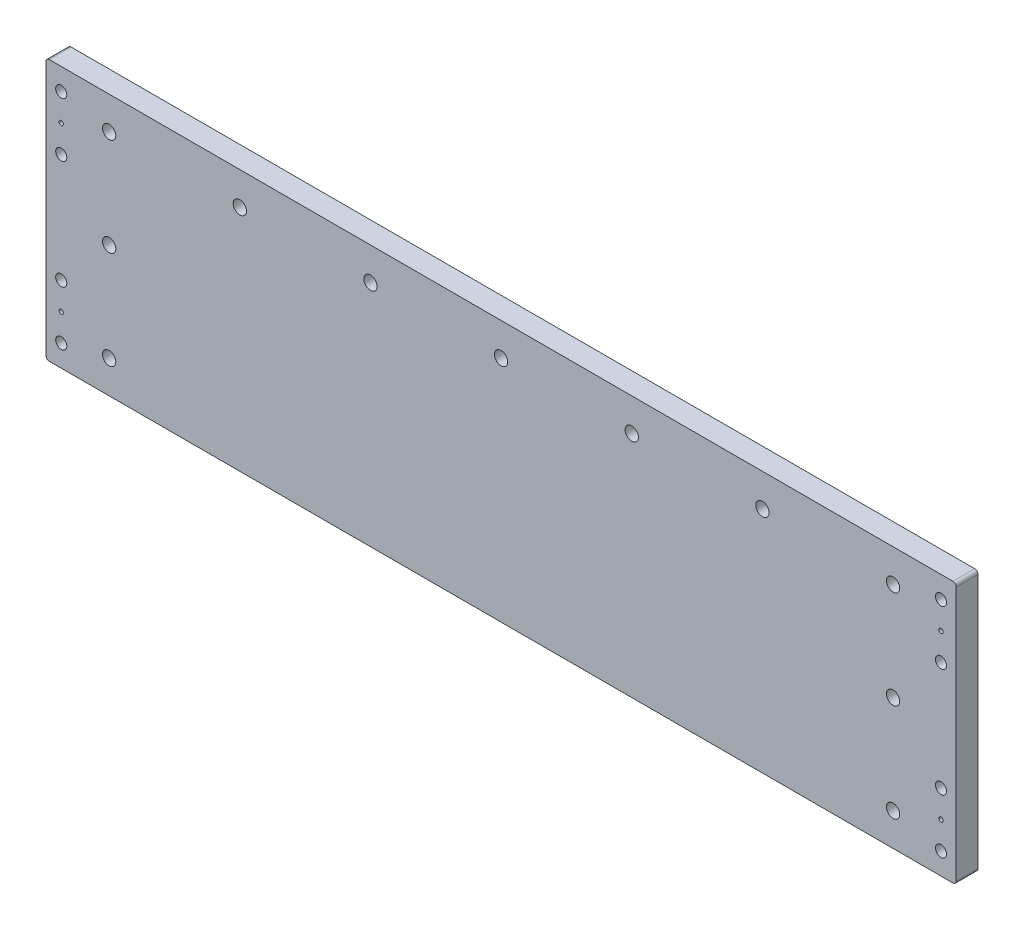
ISO-10303-21;
HEADER;
FILE_DESCRIPTION(('STEP AP214'),'2;1');
FILE_NAME('part.step','',(''),(''),'','','');
FILE_SCHEMA(('AUTOMOTIVE_DESIGN { 1 0 10303 214 1 1 1 1 }'));
ENDSEC;
DATA;
#1=APPLICATION_CONTEXT('core data for automotive mechanical design processes');
#2=APPLICATION_PROTOCOL_DEFINITION('international standard','automotive_design',2000,#1);
#3=PRODUCT_CONTEXT('',#1,'mechanical');
#4=PRODUCT('Part','Part','',(#3));
#5=PRODUCT_RELATED_PRODUCT_CATEGORY('part','',(#4));
#6=PRODUCT_DEFINITION_FORMATION('','',#4);
#7=PRODUCT_DEFINITION_CONTEXT('part definition',#1,'design');
#8=PRODUCT_DEFINITION('design','',#6,#7);
#9=PRODUCT_DEFINITION_SHAPE('','',#8);
#10=(LENGTH_UNIT() NAMED_UNIT(*) SI_UNIT(.MILLI.,.METRE.));
#11=(NAMED_UNIT(*) PLANE_ANGLE_UNIT() SI_UNIT($,.RADIAN.));
#12=(NAMED_UNIT(*) SI_UNIT($,.STERADIAN.) SOLID_ANGLE_UNIT());
#13=UNCERTAINTY_MEASURE_WITH_UNIT(LENGTH_MEASURE(1.E-05),#10,'distance_accuracy_value','');
#14=(GEOMETRIC_REPRESENTATION_CONTEXT(3) GLOBAL_UNCERTAINTY_ASSIGNED_CONTEXT((#13)) GLOBAL_UNIT_ASSIGNED_CONTEXT((#10,
#11,#12)) REPRESENTATION_CONTEXT('',''));
#15=CARTESIAN_POINT('',(0.,0.,0.));
#16=DIRECTION('',(0.,0.,1.));
#17=DIRECTION('',(1.,0.,0.));
#18=AXIS2_PLACEMENT_3D('',#15,#16,#17);
#19=CARTESIAN_POINT('',(0.,0.,5.));
#20=DIRECTION('',(0.,0.,1.));
#21=DIRECTION('',(1.,0.,0.));
#22=AXIS2_PLACEMENT_3D('',#19,#20,#21);
#23=PLANE('',#22);
#24=CARTESIAN_POINT('',(202.,-25.0000000000001,5.));
#25=DIRECTION('',(0.,0.,1.));
#26=DIRECTION('',(-1.,0.,0.));
#27=AXIS2_PLACEMENT_3D('',#24,#25,#26);
#28=CIRCLE('',#27,2.54999999999999);
#29=CARTESIAN_POINT('',(199.45,-25.0000000000001,5.));
#30=VERTEX_POINT('',#29);
#31=EDGE_CURVE('E312',#30,#30,#28,.T.);
#32=ORIENTED_EDGE('',*,*,#31,.F.);
#33=EDGE_LOOP('',(#32));
#34=FACE_BOUND('',#33,.T.);
#35=CARTESIAN_POINT('',(202.,-37.5000000000001,5.));
#36=DIRECTION('',(0.,0.,1.));
#37=DIRECTION('',(-1.,0.,0.));
#38=AXIS2_PLACEMENT_3D('',#35,#36,#37);
#39=CIRCLE('',#38,0.999999999999998);
#40=CARTESIAN_POINT('',(201.,-37.5000000000001,5.));
#41=VERTEX_POINT('',#40);
#42=EDGE_CURVE('E306',#41,#41,#39,.T.);
#43=ORIENTED_EDGE('',*,*,#42,.F.);
#44=EDGE_LOOP('',(#43));
#45=FACE_BOUND('',#44,.T.);
#46=CARTESIAN_POINT('',(202.,-50.,5.));
#47=DIRECTION('',(0.,0.,1.));
#48=DIRECTION('',(-1.,0.,0.));
#49=AXIS2_PLACEMENT_3D('',#46,#47,#48);
#50=CIRCLE('',#49,2.54999999999999);
#51=CARTESIAN_POINT('',(199.45,-50.,5.));
#52=VERTEX_POINT('',#51);
#53=EDGE_CURVE('E300',#52,#52,#50,.T.);
#54=ORIENTED_EDGE('',*,*,#53,.F.);
#55=EDGE_LOOP('',(#54));
#56=FACE_BOUND('',#55,.T.);
#57=CARTESIAN_POINT('',(202.,37.5000000000001,5.));
#58=DIRECTION('',(0.,0.,-1.));
#59=DIRECTION('',(-1.,0.,0.));
#60=AXIS2_PLACEMENT_3D('',#57,#58,#59);
#61=CIRCLE('',#60,0.999999999999998);
#62=CARTESIAN_POINT('',(201.,37.5000000000001,5.));
#63=VERTEX_POINT('',#62);
#64=EDGE_CURVE('E288',#63,#63,#61,.T.);
#65=ORIENTED_EDGE('',*,*,#64,.T.);
#66=EDGE_LOOP('',(#65));
#67=FACE_BOUND('',#66,.T.);
#68=CARTESIAN_POINT('',(-202.,-25.0000000000001,5.));
#69=DIRECTION('',(0.,0.,-1.));
#70=DIRECTION('',(1.,0.,0.));
#71=AXIS2_PLACEMENT_3D('',#68,#69,#70);
#72=CIRCLE('',#71,2.54999999999999);
#73=CARTESIAN_POINT('',(-199.45,-25.0000000000001,5.));
#74=VERTEX_POINT('',#73);
#75=EDGE_CURVE('E276',#74,#74,#72,.T.);
#76=ORIENTED_EDGE('',*,*,#75,.T.);
#77=EDGE_LOOP('',(#76));
#78=FACE_BOUND('',#77,.T.);
#79=CARTESIAN_POINT('',(-202.,-50.,5.));
#80=DIRECTION('',(0.,0.,-1.));
#81=DIRECTION('',(1.,0.,0.));
#82=AXIS2_PLACEMENT_3D('',#79,#80,#81);
#83=CIRCLE('',#82,2.54999999999999);
#84=CARTESIAN_POINT('',(-199.45,-50.,5.));
#85=VERTEX_POINT('',#84);
#86=EDGE_CURVE('E264',#85,#85,#83,.T.);
#87=ORIENTED_EDGE('',*,*,#86,.T.);
#88=EDGE_LOOP('',(#87));
#89=FACE_BOUND('',#88,.T.);
#90=CARTESIAN_POINT('',(-202.,25.0000000000001,5.));
#91=DIRECTION('',(0.,0.,1.));
#92=DIRECTION('',(1.,0.,0.));
#93=AXIS2_PLACEMENT_3D('',#90,#91,#92);
#94=CIRCLE('',#93,2.54999999999999);
#95=CARTESIAN_POINT('',(-199.45,25.0000000000001,5.));
#96=VERTEX_POINT('',#95);
#97=EDGE_CURVE('E258',#96,#96,#94,.T.);
#98=ORIENTED_EDGE('',*,*,#97,.F.);
#99=EDGE_LOOP('',(#98));
#100=FACE_BOUND('',#99,.T.);
#101=CARTESIAN_POINT('',(-202.,37.5000000000001,5.));
#102=DIRECTION('',(0.,0.,1.));
#103=DIRECTION('',(1.,0.,0.));
#104=AXIS2_PLACEMENT_3D('',#101,#102,#103);
#105=CIRCLE('',#104,0.999999999999998);
#106=CARTESIAN_POINT('',(-201.,37.5000000000001,5.));
#107=VERTEX_POINT('',#106);
#108=EDGE_CURVE('E252',#107,#107,#105,.T.);
#109=ORIENTED_EDGE('',*,*,#108,.F.);
#110=EDGE_LOOP('',(#109));
#111=FACE_BOUND('',#110,.T.);
#112=CARTESIAN_POINT('',(-202.,50.,5.));
#113=DIRECTION('',(0.,0.,1.));
#114=DIRECTION('',(1.,0.,0.));
#115=AXIS2_PLACEMENT_3D('',#112,#113,#114);
#116=CIRCLE('',#115,2.54999999999999);
#117=CARTESIAN_POINT('',(-199.45,50.,5.));
#118=VERTEX_POINT('',#117);
#119=EDGE_CURVE('E246',#118,#118,#116,.T.);
#120=ORIENTED_EDGE('',*,*,#119,.F.);
#121=EDGE_LOOP('',(#120));
#122=FACE_BOUND('',#121,.T.);
#123=CARTESIAN_POINT('',(180.,0.,5.));
#124=DIRECTION('',(0.,0.,1.));
#125=DIRECTION('',(1.,0.,0.));
#126=AXIS2_PLACEMENT_3D('',#123,#124,#125);
#127=CIRCLE('',#126,3.04999999999999);
#128=CARTESIAN_POINT('',(183.05,0.,5.));
#129=VERTEX_POINT('',#128);
#130=EDGE_CURVE('E240',#129,#129,#127,.T.);
#131=ORIENTED_EDGE('',*,*,#130,.F.);
#132=EDGE_LOOP('',(#131));
#133=FACE_BOUND('',#132,.T.);
#134=CARTESIAN_POINT('',(60.0000000000001,45.,5.));
#135=DIRECTION('',(0.,0.,1.));
#136=DIRECTION('',(1.,0.,0.));
#137=AXIS2_PLACEMENT_3D('',#134,#135,#136);
#138=CIRCLE('',#137,3.04999999999999);
#139=CARTESIAN_POINT('',(63.0500000000001,45.,5.));
#140=VERTEX_POINT('',#139);
#141=EDGE_CURVE('E234',#140,#140,#138,.T.);
#142=ORIENTED_EDGE('',*,*,#141,.F.);
#143=EDGE_LOOP('',(#142));
#144=FACE_BOUND('',#143,.T.);
#145=CARTESIAN_POINT('',(-59.9999999999999,45.,5.));
#146=DIRECTION('',(0.,0.,1.));
#147=DIRECTION('',(1.,0.,0.));
#148=AXIS2_PLACEMENT_3D('',#145,#146,#147);
#149=CIRCLE('',#148,3.05);
#150=CARTESIAN_POINT('',(-56.9499999999999,45.,5.));
#151=VERTEX_POINT('',#150);
#152=EDGE_CURVE('E228',#151,#151,#149,.T.);
#153=ORIENTED_EDGE('',*,*,#152,.F.);
#154=EDGE_LOOP('',(#153));
#155=FACE_BOUND('',#154,.T.);
#156=CARTESIAN_POINT('',(-180.,0.,5.));
#157=DIRECTION('',(0.,0.,1.));
#158=DIRECTION('',(1.,0.,0.));
#159=AXIS2_PLACEMENT_3D('',#156,#157,#158);
#160=CIRCLE('',#159,3.04999999999999);
#161=CARTESIAN_POINT('',(-176.95,0.,5.));
#162=VERTEX_POINT('',#161);
#163=EDGE_CURVE('E222',#162,#162,#160,.T.);
#164=ORIENTED_EDGE('',*,*,#163,.F.);
#165=EDGE_LOOP('',(#164));
#166=FACE_BOUND('',#165,.T.);
#167=CARTESIAN_POINT('',(120.,45.,5.));
#168=DIRECTION('',(0.,0.,1.));
#169=DIRECTION('',(1.,0.,0.));
#170=AXIS2_PLACEMENT_3D('',#167,#168,#169);
#171=CIRCLE('',#170,3.04999999999999);
#172=CARTESIAN_POINT('',(123.05,45.,5.));
#173=VERTEX_POINT('',#172);
#174=EDGE_CURVE('E216',#173,#173,#171,.T.);
#175=ORIENTED_EDGE('',*,*,#174,.F.);
#176=EDGE_LOOP('',(#175));
#177=FACE_BOUND('',#176,.T.);
#178=CARTESIAN_POINT('',(-120.,45.,5.));
#179=DIRECTION('',(0.,0.,1.));
#180=DIRECTION('',(1.,0.,0.));
#181=AXIS2_PLACEMENT_3D('',#178,#179,#180);
#182=CIRCLE('',#181,3.04999999999999);
#183=CARTESIAN_POINT('',(-116.95,45.,5.));
#184=VERTEX_POINT('',#183);
#185=EDGE_CURVE('E210',#184,#184,#182,.T.);
#186=ORIENTED_EDGE('',*,*,#185,.F.);
#187=EDGE_LOOP('',(#186));
#188=FACE_BOUND('',#187,.T.);
#189=CARTESIAN_POINT('',(0.,45.,5.));
#190=DIRECTION('',(0.,0.,1.));
#191=DIRECTION('',(1.,0.,0.));
#192=AXIS2_PLACEMENT_3D('',#189,#190,#191);
#193=CIRCLE('',#192,3.05);
#194=CARTESIAN_POINT('',(3.05000000000008,45.,5.));
#195=VERTEX_POINT('',#194);
#196=EDGE_CURVE('E204',#195,#195,#193,.T.);
#197=ORIENTED_EDGE('',*,*,#196,.F.);
#198=EDGE_LOOP('',(#197));
#199=FACE_BOUND('',#198,.T.);
#200=CARTESIAN_POINT('',(-180.,-45.,5.));
#201=DIRECTION('',(0.,0.,1.));
#202=DIRECTION('',(1.,0.,0.));
#203=AXIS2_PLACEMENT_3D('',#200,#201,#202);
#204=CIRCLE('',#203,3.04999999999999);
#205=CARTESIAN_POINT('',(-176.95,-45.,5.));
#206=VERTEX_POINT('',#205);
#207=EDGE_CURVE('E198',#206,#206,#204,.T.);
#208=ORIENTED_EDGE('',*,*,#207,.F.);
#209=EDGE_LOOP('',(#208));
#210=FACE_BOUND('',#209,.T.);
#211=CARTESIAN_POINT('',(180.,-45.,5.));
#212=DIRECTION('',(0.,0.,1.));
#213=DIRECTION('',(1.,0.,0.));
#214=AXIS2_PLACEMENT_3D('',#211,#212,#213);
#215=CIRCLE('',#214,3.04999999999999);
#216=CARTESIAN_POINT('',(183.05,-45.,5.));
#217=VERTEX_POINT('',#216);
#218=EDGE_CURVE('E192',#217,#217,#215,.T.);
#219=ORIENTED_EDGE('',*,*,#218,.F.);
#220=EDGE_LOOP('',(#219));
#221=FACE_BOUND('',#220,.T.);
#222=CARTESIAN_POINT('',(180.,45.,5.));
#223=DIRECTION('',(0.,0.,1.));
#224=DIRECTION('',(1.,0.,0.));
#225=AXIS2_PLACEMENT_3D('',#222,#223,#224);
#226=CIRCLE('',#225,3.04999999999999);
#227=CARTESIAN_POINT('',(183.05,45.,5.));
#228=VERTEX_POINT('',#227);
#229=EDGE_CURVE('E186',#228,#228,#226,.T.);
#230=ORIENTED_EDGE('',*,*,#229,.F.);
#231=EDGE_LOOP('',(#230));
#232=FACE_BOUND('',#231,.T.);
#233=CARTESIAN_POINT('',(-180.,45.,5.));
#234=DIRECTION('',(0.,0.,1.));
#235=DIRECTION('',(1.,0.,0.));
#236=AXIS2_PLACEMENT_3D('',#233,#234,#235);
#237=CIRCLE('',#236,3.04999999999999);
#238=CARTESIAN_POINT('',(-176.95,45.,5.));
#239=VERTEX_POINT('',#238);
#240=EDGE_CURVE('E180',#239,#239,#237,.T.);
#241=ORIENTED_EDGE('',*,*,#240,.F.);
#242=EDGE_LOOP('',(#241));
#243=FACE_BOUND('',#242,.T.);
#244=DIRECTION('',(0.,-1.,0.));
#245=VECTOR('',#244,1.);
#246=CARTESIAN_POINT('',(-209.,-60.,5.));
#247=LINE('',#246,#245);
#248=CARTESIAN_POINT('',(-209.,58.5,5.));
#249=VERTEX_POINT('',#248);
#250=CARTESIAN_POINT('',(-209.,-58.5,5.));
#251=VERTEX_POINT('',#250);
#252=EDGE_CURVE('E140',#249,#251,#247,.T.);
#253=ORIENTED_EDGE('',*,*,#252,.T.);
#254=CARTESIAN_POINT('',(-207.5,-58.5,5.));
#255=DIRECTION('',(0.,0.,1.));
#256=DIRECTION('',(1.,0.,0.));
#257=AXIS2_PLACEMENT_3D('',#254,#255,#256);
#258=CIRCLE('',#257,1.5);
#259=CARTESIAN_POINT('',(-207.5,-60.,5.));
#260=VERTEX_POINT('',#259);
#261=EDGE_CURVE('E155',#251,#260,#258,.T.);
#262=ORIENTED_EDGE('',*,*,#261,.T.);
#263=DIRECTION('',(1.,0.,0.));
#264=VECTOR('',#263,1.);
#265=CARTESIAN_POINT('',(209.,-60.,5.));
#266=LINE('',#265,#264);
#267=CARTESIAN_POINT('',(207.5,-60.,5.));
#268=VERTEX_POINT('',#267);
#269=EDGE_CURVE('E122',#260,#268,#266,.T.);
#270=ORIENTED_EDGE('',*,*,#269,.T.);
#271=CARTESIAN_POINT('',(207.5,-58.5,5.));
#272=DIRECTION('',(0.,0.,1.));
#273=DIRECTION('',(1.,0.,0.));
#274=AXIS2_PLACEMENT_3D('',#271,#272,#273);
#275=CIRCLE('',#274,1.5);
#276=CARTESIAN_POINT('',(209.,-58.5,5.));
#277=VERTEX_POINT('',#276);
#278=EDGE_CURVE('E153',#268,#277,#275,.T.);
#279=ORIENTED_EDGE('',*,*,#278,.T.);
#280=DIRECTION('',(0.,1.,0.));
#281=VECTOR('',#280,1.);
#282=CARTESIAN_POINT('',(209.,-60.,5.));
#283=LINE('',#282,#281);
#284=CARTESIAN_POINT('',(209.,58.5,5.));
#285=VERTEX_POINT('',#284);
#286=EDGE_CURVE('E166',#277,#285,#283,.T.);
#287=ORIENTED_EDGE('',*,*,#286,.T.);
#288=CARTESIAN_POINT('',(207.5,58.5,5.));
#289=DIRECTION('',(0.,0.,1.));
#290=DIRECTION('',(1.,0.,0.));
#291=AXIS2_PLACEMENT_3D('',#288,#289,#290);
#292=CIRCLE('',#291,1.5);
#293=CARTESIAN_POINT('',(207.5,60.,5.));
#294=VERTEX_POINT('',#293);
#295=EDGE_CURVE('E57',#285,#294,#292,.T.);
#296=ORIENTED_EDGE('',*,*,#295,.T.);
#297=DIRECTION('',(-1.,0.,0.));
#298=VECTOR('',#297,1.);
#299=CARTESIAN_POINT('',(209.,60.,5.));
#300=LINE('',#299,#298);
#301=CARTESIAN_POINT('',(-207.5,60.,5.));
#302=VERTEX_POINT('',#301);
#303=EDGE_CURVE('E141',#294,#302,#300,.T.);
#304=ORIENTED_EDGE('',*,*,#303,.T.);
#305=CARTESIAN_POINT('',(-207.5,58.5,5.));
#306=DIRECTION('',(0.,0.,1.));
#307=DIRECTION('',(1.,0.,0.));
#308=AXIS2_PLACEMENT_3D('',#305,#306,#307);
#309=CIRCLE('',#308,1.5);
#310=EDGE_CURVE('E150',#302,#249,#309,.T.);
#311=ORIENTED_EDGE('',*,*,#310,.T.);
#312=EDGE_LOOP('',(#253,#262,#270,#279,#287,#296,#304,#311));
#313=FACE_BOUND('',#312,.T.);
#314=CARTESIAN_POINT('',(-202.,-37.5000000000001,5.));
#315=DIRECTION('',(0.,0.,-1.));
#316=DIRECTION('',(1.,0.,0.));
#317=AXIS2_PLACEMENT_3D('',#314,#315,#316);
#318=CIRCLE('',#317,0.999999999999998);
#319=CARTESIAN_POINT('',(-201.,-37.5000000000001,5.));
#320=VERTEX_POINT('',#319);
#321=EDGE_CURVE('E270',#320,#320,#318,.T.);
#322=ORIENTED_EDGE('',*,*,#321,.T.);
#323=EDGE_LOOP('',(#322));
#324=FACE_BOUND('',#323,.T.);
#325=CARTESIAN_POINT('',(202.,50.,5.));
#326=DIRECTION('',(0.,0.,-1.));
#327=DIRECTION('',(-1.,0.,0.));
#328=AXIS2_PLACEMENT_3D('',#325,#326,#327);
#329=CIRCLE('',#328,2.54999999999999);
#330=CARTESIAN_POINT('',(199.45,50.,5.));
#331=VERTEX_POINT('',#330);
#332=EDGE_CURVE('E282',#331,#331,#329,.T.);
#333=ORIENTED_EDGE('',*,*,#332,.T.);
#334=EDGE_LOOP('',(#333));
#335=FACE_BOUND('',#334,.T.);
#336=CARTESIAN_POINT('',(202.,25.0000000000001,5.));
#337=DIRECTION('',(0.,0.,-1.));
#338=DIRECTION('',(-1.,0.,0.));
#339=AXIS2_PLACEMENT_3D('',#336,#337,#338);
#340=CIRCLE('',#339,2.54999999999999);
#341=CARTESIAN_POINT('',(199.45,25.0000000000001,5.));
#342=VERTEX_POINT('',#341);
#343=EDGE_CURVE('E294',#342,#342,#340,.T.);
#344=ORIENTED_EDGE('',*,*,#343,.T.);
#345=EDGE_LOOP('',(#344));
#346=FACE_BOUND('',#345,.T.);
#347=ADVANCED_FACE('F36',(#34,#45,#56,#67,#78,#89,#100,#111,#122,#133,#144,#155,#166,#177,#188,
#199,#210,#221,#232,#243,#313,#324,#335,#346),#23,.T.);
#348=CARTESIAN_POINT('',(0.,0.,-5.));
#349=DIRECTION('',(0.,0.,1.));
#350=DIRECTION('',(1.,0.,0.));
#351=AXIS2_PLACEMENT_3D('',#348,#349,#350);
#352=PLANE('',#351);
#353=CARTESIAN_POINT('',(202.,-25.0000000000001,-5.));
#354=DIRECTION('',(0.,0.,1.));
#355=DIRECTION('',(-1.,0.,0.));
#356=AXIS2_PLACEMENT_3D('',#353,#354,#355);
#357=CIRCLE('',#356,2.54999999999999);
#358=CARTESIAN_POINT('',(199.45,-25.0000000000001,-5.));
#359=VERTEX_POINT('',#358);
#360=EDGE_CURVE('E309',#359,#359,#357,.T.);
#361=ORIENTED_EDGE('',*,*,#360,.T.);
#362=EDGE_LOOP('',(#361));
#363=FACE_BOUND('',#362,.T.);
#364=CARTESIAN_POINT('',(202.,-37.5000000000001,-5.));
#365=DIRECTION('',(0.,0.,1.));
#366=DIRECTION('',(-1.,0.,0.));
#367=AXIS2_PLACEMENT_3D('',#364,#365,#366);
#368=CIRCLE('',#367,0.999999999999998);
#369=CARTESIAN_POINT('',(201.,-37.5000000000001,-5.));
#370=VERTEX_POINT('',#369);
#371=EDGE_CURVE('E303',#370,#370,#368,.T.);
#372=ORIENTED_EDGE('',*,*,#371,.T.);
#373=EDGE_LOOP('',(#372));
#374=FACE_BOUND('',#373,.T.);
#375=CARTESIAN_POINT('',(202.,-50.,-5.));
#376=DIRECTION('',(0.,0.,1.));
#377=DIRECTION('',(-1.,0.,0.));
#378=AXIS2_PLACEMENT_3D('',#375,#376,#377);
#379=CIRCLE('',#378,2.54999999999999);
#380=CARTESIAN_POINT('',(199.45,-50.,-5.));
#381=VERTEX_POINT('',#380);
#382=EDGE_CURVE('E297',#381,#381,#379,.T.);
#383=ORIENTED_EDGE('',*,*,#382,.T.);
#384=EDGE_LOOP('',(#383));
#385=FACE_BOUND('',#384,.T.);
#386=CARTESIAN_POINT('',(202.,37.5000000000001,-5.));
#387=DIRECTION('',(0.,0.,-1.));
#388=DIRECTION('',(-1.,0.,0.));
#389=AXIS2_PLACEMENT_3D('',#386,#387,#388);
#390=CIRCLE('',#389,0.999999999999998);
#391=CARTESIAN_POINT('',(201.,37.5000000000001,-5.));
#392=VERTEX_POINT('',#391);
#393=EDGE_CURVE('E285',#392,#392,#390,.T.);
#394=ORIENTED_EDGE('',*,*,#393,.F.);
#395=EDGE_LOOP('',(#394));
#396=FACE_BOUND('',#395,.T.);
#397=CARTESIAN_POINT('',(-202.,-25.0000000000001,-5.));
#398=DIRECTION('',(0.,0.,-1.));
#399=DIRECTION('',(1.,0.,0.));
#400=AXIS2_PLACEMENT_3D('',#397,#398,#399);
#401=CIRCLE('',#400,2.54999999999999);
#402=CARTESIAN_POINT('',(-199.45,-25.0000000000001,-5.));
#403=VERTEX_POINT('',#402);
#404=EDGE_CURVE('E273',#403,#403,#401,.T.);
#405=ORIENTED_EDGE('',*,*,#404,.F.);
#406=EDGE_LOOP('',(#405));
#407=FACE_BOUND('',#406,.T.);
#408=CARTESIAN_POINT('',(-202.,-50.,-5.));
#409=DIRECTION('',(0.,0.,-1.));
#410=DIRECTION('',(1.,0.,0.));
#411=AXIS2_PLACEMENT_3D('',#408,#409,#410);
#412=CIRCLE('',#411,2.54999999999999);
#413=CARTESIAN_POINT('',(-199.45,-50.,-5.));
#414=VERTEX_POINT('',#413);
#415=EDGE_CURVE('E261',#414,#414,#412,.T.);
#416=ORIENTED_EDGE('',*,*,#415,.F.);
#417=EDGE_LOOP('',(#416));
#418=FACE_BOUND('',#417,.T.);
#419=CARTESIAN_POINT('',(-202.,25.0000000000001,-5.));
#420=DIRECTION('',(0.,0.,1.));
#421=DIRECTION('',(1.,0.,0.));
#422=AXIS2_PLACEMENT_3D('',#419,#420,#421);
#423=CIRCLE('',#422,2.54999999999999);
#424=CARTESIAN_POINT('',(-199.45,25.0000000000001,-5.));
#425=VERTEX_POINT('',#424);
#426=EDGE_CURVE('E255',#425,#425,#423,.T.);
#427=ORIENTED_EDGE('',*,*,#426,.T.);
#428=EDGE_LOOP('',(#427));
#429=FACE_BOUND('',#428,.T.);
#430=CARTESIAN_POINT('',(-202.,37.5000000000001,-5.));
#431=DIRECTION('',(0.,0.,1.));
#432=DIRECTION('',(1.,0.,0.));
#433=AXIS2_PLACEMENT_3D('',#430,#431,#432);
#434=CIRCLE('',#433,0.999999999999998);
#435=CARTESIAN_POINT('',(-201.,37.5000000000001,-5.));
#436=VERTEX_POINT('',#435);
#437=EDGE_CURVE('E249',#436,#436,#434,.T.);
#438=ORIENTED_EDGE('',*,*,#437,.T.);
#439=EDGE_LOOP('',(#438));
#440=FACE_BOUND('',#439,.T.);
#441=CARTESIAN_POINT('',(-202.,50.,-5.));
#442=DIRECTION('',(0.,0.,1.));
#443=DIRECTION('',(1.,0.,0.));
#444=AXIS2_PLACEMENT_3D('',#441,#442,#443);
#445=CIRCLE('',#444,2.54999999999999);
#446=CARTESIAN_POINT('',(-199.45,50.,-5.));
#447=VERTEX_POINT('',#446);
#448=EDGE_CURVE('E243',#447,#447,#445,.T.);
#449=ORIENTED_EDGE('',*,*,#448,.T.);
#450=EDGE_LOOP('',(#449));
#451=FACE_BOUND('',#450,.T.);
#452=CARTESIAN_POINT('',(180.,0.,-5.));
#453=DIRECTION('',(0.,0.,1.));
#454=DIRECTION('',(1.,0.,0.));
#455=AXIS2_PLACEMENT_3D('',#452,#453,#454);
#456=CIRCLE('',#455,3.04999999999999);
#457=CARTESIAN_POINT('',(183.05,0.,-5.));
#458=VERTEX_POINT('',#457);
#459=EDGE_CURVE('E237',#458,#458,#456,.T.);
#460=ORIENTED_EDGE('',*,*,#459,.T.);
#461=EDGE_LOOP('',(#460));
#462=FACE_BOUND('',#461,.T.);
#463=CARTESIAN_POINT('',(60.0000000000001,45.,-5.));
#464=DIRECTION('',(0.,0.,1.));
#465=DIRECTION('',(1.,0.,0.));
#466=AXIS2_PLACEMENT_3D('',#463,#464,#465);
#467=CIRCLE('',#466,3.04999999999999);
#468=CARTESIAN_POINT('',(63.0500000000001,45.,-5.));
#469=VERTEX_POINT('',#468);
#470=EDGE_CURVE('E231',#469,#469,#467,.T.);
#471=ORIENTED_EDGE('',*,*,#470,.T.);
#472=EDGE_LOOP('',(#471));
#473=FACE_BOUND('',#472,.T.);
#474=CARTESIAN_POINT('',(-59.9999999999999,45.,-5.));
#475=DIRECTION('',(0.,0.,1.));
#476=DIRECTION('',(1.,0.,0.));
#477=AXIS2_PLACEMENT_3D('',#474,#475,#476);
#478=CIRCLE('',#477,3.05);
#479=CARTESIAN_POINT('',(-56.9499999999999,45.,-5.));
#480=VERTEX_POINT('',#479);
#481=EDGE_CURVE('E225',#480,#480,#478,.T.);
#482=ORIENTED_EDGE('',*,*,#481,.T.);
#483=EDGE_LOOP('',(#482));
#484=FACE_BOUND('',#483,.T.);
#485=CARTESIAN_POINT('',(-180.,0.,-5.));
#486=DIRECTION('',(0.,0.,1.));
#487=DIRECTION('',(1.,0.,0.));
#488=AXIS2_PLACEMENT_3D('',#485,#486,#487);
#489=CIRCLE('',#488,3.04999999999999);
#490=CARTESIAN_POINT('',(-176.95,0.,-5.));
#491=VERTEX_POINT('',#490);
#492=EDGE_CURVE('E219',#491,#491,#489,.T.);
#493=ORIENTED_EDGE('',*,*,#492,.T.);
#494=EDGE_LOOP('',(#493));
#495=FACE_BOUND('',#494,.T.);
#496=CARTESIAN_POINT('',(120.,45.,-5.));
#497=DIRECTION('',(0.,0.,1.));
#498=DIRECTION('',(1.,0.,0.));
#499=AXIS2_PLACEMENT_3D('',#496,#497,#498);
#500=CIRCLE('',#499,3.04999999999999);
#501=CARTESIAN_POINT('',(123.05,45.,-5.));
#502=VERTEX_POINT('',#501);
#503=EDGE_CURVE('E213',#502,#502,#500,.T.);
#504=ORIENTED_EDGE('',*,*,#503,.T.);
#505=EDGE_LOOP('',(#504));
#506=FACE_BOUND('',#505,.T.);
#507=CARTESIAN_POINT('',(-120.,45.,-5.));
#508=DIRECTION('',(0.,0.,1.));
#509=DIRECTION('',(1.,0.,0.));
#510=AXIS2_PLACEMENT_3D('',#507,#508,#509);
#511=CIRCLE('',#510,3.04999999999999);
#512=CARTESIAN_POINT('',(-116.95,45.,-5.));
#513=VERTEX_POINT('',#512);
#514=EDGE_CURVE('E207',#513,#513,#511,.T.);
#515=ORIENTED_EDGE('',*,*,#514,.T.);
#516=EDGE_LOOP('',(#515));
#517=FACE_BOUND('',#516,.T.);
#518=CARTESIAN_POINT('',(0.,45.,-5.));
#519=DIRECTION('',(0.,0.,1.));
#520=DIRECTION('',(1.,0.,0.));
#521=AXIS2_PLACEMENT_3D('',#518,#519,#520);
#522=CIRCLE('',#521,3.05);
#523=CARTESIAN_POINT('',(3.05000000000008,45.,-5.));
#524=VERTEX_POINT('',#523);
#525=EDGE_CURVE('E201',#524,#524,#522,.T.);
#526=ORIENTED_EDGE('',*,*,#525,.T.);
#527=EDGE_LOOP('',(#526));
#528=FACE_BOUND('',#527,.T.);
#529=CARTESIAN_POINT('',(-180.,-45.,-5.));
#530=DIRECTION('',(0.,0.,1.));
#531=DIRECTION('',(1.,0.,0.));
#532=AXIS2_PLACEMENT_3D('',#529,#530,#531);
#533=CIRCLE('',#532,3.04999999999999);
#534=CARTESIAN_POINT('',(-176.95,-45.,-5.));
#535=VERTEX_POINT('',#534);
#536=EDGE_CURVE('E195',#535,#535,#533,.T.);
#537=ORIENTED_EDGE('',*,*,#536,.T.);
#538=EDGE_LOOP('',(#537));
#539=FACE_BOUND('',#538,.T.);
#540=CARTESIAN_POINT('',(180.,-45.,-5.));
#541=DIRECTION('',(0.,0.,1.));
#542=DIRECTION('',(1.,0.,0.));
#543=AXIS2_PLACEMENT_3D('',#540,#541,#542);
#544=CIRCLE('',#543,3.04999999999999);
#545=CARTESIAN_POINT('',(183.05,-45.,-5.));
#546=VERTEX_POINT('',#545);
#547=EDGE_CURVE('E189',#546,#546,#544,.T.);
#548=ORIENTED_EDGE('',*,*,#547,.T.);
#549=EDGE_LOOP('',(#548));
#550=FACE_BOUND('',#549,.T.);
#551=CARTESIAN_POINT('',(180.,45.,-5.));
#552=DIRECTION('',(0.,0.,1.));
#553=DIRECTION('',(1.,0.,0.));
#554=AXIS2_PLACEMENT_3D('',#551,#552,#553);
#555=CIRCLE('',#554,3.04999999999999);
#556=CARTESIAN_POINT('',(183.05,45.,-5.));
#557=VERTEX_POINT('',#556);
#558=EDGE_CURVE('E183',#557,#557,#555,.T.);
#559=ORIENTED_EDGE('',*,*,#558,.T.);
#560=EDGE_LOOP('',(#559));
#561=FACE_BOUND('',#560,.T.);
#562=CARTESIAN_POINT('',(-180.,45.,-5.));
#563=DIRECTION('',(0.,0.,1.));
#564=DIRECTION('',(1.,0.,0.));
#565=AXIS2_PLACEMENT_3D('',#562,#563,#564);
#566=CIRCLE('',#565,3.04999999999999);
#567=CARTESIAN_POINT('',(-176.95,45.,-5.));
#568=VERTEX_POINT('',#567);
#569=EDGE_CURVE('E135',#568,#568,#566,.T.);
#570=ORIENTED_EDGE('',*,*,#569,.T.);
#571=EDGE_LOOP('',(#570));
#572=FACE_BOUND('',#571,.T.);
#573=DIRECTION('',(1.,0.,0.));
#574=VECTOR('',#573,1.);
#575=CARTESIAN_POINT('',(209.,-60.,-5.));
#576=LINE('',#575,#574);
#577=CARTESIAN_POINT('',(-207.5,-60.,-5.));
#578=VERTEX_POINT('',#577);
#579=CARTESIAN_POINT('',(207.5,-60.,-5.));
#580=VERTEX_POINT('',#579);
#581=EDGE_CURVE('E119',#578,#580,#576,.T.);
#582=ORIENTED_EDGE('',*,*,#581,.F.);
#583=CARTESIAN_POINT('',(-207.5,-58.5,-5.));
#584=DIRECTION('',(0.,0.,1.));
#585=DIRECTION('',(1.,0.,0.));
#586=AXIS2_PLACEMENT_3D('',#583,#584,#585);
#587=CIRCLE('',#586,1.5);
#588=CARTESIAN_POINT('',(-209.,-58.5,-5.));
#589=VERTEX_POINT('',#588);
#590=EDGE_CURVE('E102',#578,#589,#587,.F.);
#591=ORIENTED_EDGE('',*,*,#590,.T.);
#592=DIRECTION('',(0.,-1.,0.));
#593=VECTOR('',#592,1.);
#594=CARTESIAN_POINT('',(-209.,-60.,-5.));
#595=LINE('',#594,#593);
#596=CARTESIAN_POINT('',(-209.,58.5,-5.));
#597=VERTEX_POINT('',#596);
#598=EDGE_CURVE('E130',#597,#589,#595,.T.);
#599=ORIENTED_EDGE('',*,*,#598,.F.);
#600=CARTESIAN_POINT('',(-207.5,58.5,-5.));
#601=DIRECTION('',(0.,0.,1.));
#602=DIRECTION('',(1.,0.,0.));
#603=AXIS2_PLACEMENT_3D('',#600,#601,#602);
#604=CIRCLE('',#603,1.5);
#605=CARTESIAN_POINT('',(-207.5,60.,-5.));
#606=VERTEX_POINT('',#605);
#607=EDGE_CURVE('E123',#597,#606,#604,.F.);
#608=ORIENTED_EDGE('',*,*,#607,.T.);
#609=DIRECTION('',(-1.,0.,0.));
#610=VECTOR('',#609,1.);
#611=CARTESIAN_POINT('',(209.,60.,-5.));
#612=LINE('',#611,#610);
#613=CARTESIAN_POINT('',(207.5,60.,-5.));
#614=VERTEX_POINT('',#613);
#615=EDGE_CURVE('E133',#614,#606,#612,.T.);
#616=ORIENTED_EDGE('',*,*,#615,.F.);
#617=CARTESIAN_POINT('',(207.5,58.5,-5.));
#618=DIRECTION('',(0.,0.,1.));
#619=DIRECTION('',(1.,0.,0.));
#620=AXIS2_PLACEMENT_3D('',#617,#618,#619);
#621=CIRCLE('',#620,1.5);
#622=CARTESIAN_POINT('',(209.,58.5,-5.));
#623=VERTEX_POINT('',#622);
#624=EDGE_CURVE('E144',#614,#623,#621,.F.);
#625=ORIENTED_EDGE('',*,*,#624,.T.);
#626=DIRECTION('',(0.,1.,0.));
#627=VECTOR('',#626,1.);
#628=CARTESIAN_POINT('',(209.,-60.,-5.));
#629=LINE('',#628,#627);
#630=CARTESIAN_POINT('',(209.,-58.5,-5.));
#631=VERTEX_POINT('',#630);
#632=EDGE_CURVE('E129',#631,#623,#629,.T.);
#633=ORIENTED_EDGE('',*,*,#632,.F.);
#634=CARTESIAN_POINT('',(207.5,-58.5,-5.));
#635=DIRECTION('',(0.,0.,1.));
#636=DIRECTION('',(1.,0.,0.));
#637=AXIS2_PLACEMENT_3D('',#634,#635,#636);
#638=CIRCLE('',#637,1.5);
#639=EDGE_CURVE('E113',#631,#580,#638,.F.);
#640=ORIENTED_EDGE('',*,*,#639,.T.);
#641=EDGE_LOOP('',(#582,#591,#599,#608,#616,#625,#633,#640));
#642=FACE_BOUND('',#641,.T.);
#643=CARTESIAN_POINT('',(-202.,-37.5000000000001,-5.));
#644=DIRECTION('',(0.,0.,-1.));
#645=DIRECTION('',(1.,0.,0.));
#646=AXIS2_PLACEMENT_3D('',#643,#644,#645);
#647=CIRCLE('',#646,0.999999999999998);
#648=CARTESIAN_POINT('',(-201.,-37.5000000000001,-5.));
#649=VERTEX_POINT('',#648);
#650=EDGE_CURVE('E267',#649,#649,#647,.T.);
#651=ORIENTED_EDGE('',*,*,#650,.F.);
#652=EDGE_LOOP('',(#651));
#653=FACE_BOUND('',#652,.T.);
#654=CARTESIAN_POINT('',(202.,50.,-5.));
#655=DIRECTION('',(0.,0.,-1.));
#656=DIRECTION('',(-1.,0.,0.));
#657=AXIS2_PLACEMENT_3D('',#654,#655,#656);
#658=CIRCLE('',#657,2.54999999999999);
#659=CARTESIAN_POINT('',(199.45,50.,-5.));
#660=VERTEX_POINT('',#659);
#661=EDGE_CURVE('E279',#660,#660,#658,.T.);
#662=ORIENTED_EDGE('',*,*,#661,.F.);
#663=EDGE_LOOP('',(#662));
#664=FACE_BOUND('',#663,.T.);
#665=CARTESIAN_POINT('',(202.,25.0000000000001,-5.));
#666=DIRECTION('',(0.,0.,-1.));
#667=DIRECTION('',(-1.,0.,0.));
#668=AXIS2_PLACEMENT_3D('',#665,#666,#667);
#669=CIRCLE('',#668,2.54999999999999);
#670=CARTESIAN_POINT('',(199.45,25.0000000000001,-5.));
#671=VERTEX_POINT('',#670);
#672=EDGE_CURVE('E291',#671,#671,#669,.T.);
#673=ORIENTED_EDGE('',*,*,#672,.F.);
#674=EDGE_LOOP('',(#673));
#675=FACE_BOUND('',#674,.T.);
#676=ADVANCED_FACE('F126',(#363,#374,#385,#396,#407,#418,#429,#440,#451,#462,#473,#484,#495,
#506,#517,#528,#539,#550,#561,#572,#642,#653,#664,#675),#352,.F.);
#677=CARTESIAN_POINT('',(-209.,-60.,5.));
#678=DIRECTION('',(1.,0.,0.));
#679=DIRECTION('',(0.,0.,-1.));
#680=AXIS2_PLACEMENT_3D('',#677,#678,#679);
#681=PLANE('',#680);
#682=ORIENTED_EDGE('',*,*,#598,.T.);
#683=DIRECTION('',(0.,0.,-1.));
#684=VECTOR('',#683,1.);
#685=CARTESIAN_POINT('',(-209.,-58.5,5.));
#686=LINE('',#685,#684);
#687=EDGE_CURVE('E107',#589,#251,#686,.F.);
#688=ORIENTED_EDGE('',*,*,#687,.T.);
#689=ORIENTED_EDGE('',*,*,#252,.F.);
#690=DIRECTION('',(0.,0.,-1.));
#691=VECTOR('',#690,1.);
#692=CARTESIAN_POINT('',(-209.,58.5,5.));
#693=LINE('',#692,#691);
#694=EDGE_CURVE('E112',#249,#597,#693,.T.);
#695=ORIENTED_EDGE('',*,*,#694,.T.);
#696=EDGE_LOOP('',(#682,#688,#689,#695));
#697=FACE_BOUND('',#696,.T.);
#698=ADVANCED_FACE('F465',(#697),#681,.F.);
#699=CARTESIAN_POINT('',(209.,-60.,5.));
#700=DIRECTION('',(0.,1.,0.));
#701=DIRECTION('',(-1.,0.,0.));
#702=AXIS2_PLACEMENT_3D('',#699,#700,#701);
#703=PLANE('',#702);
#704=ORIENTED_EDGE('',*,*,#269,.F.);
#705=DIRECTION('',(0.,0.,-1.));
#706=VECTOR('',#705,1.);
#707=CARTESIAN_POINT('',(-207.5,-60.,5.));
#708=LINE('',#707,#706);
#709=EDGE_CURVE('E106',#260,#578,#708,.T.);
#710=ORIENTED_EDGE('',*,*,#709,.T.);
#711=ORIENTED_EDGE('',*,*,#581,.T.);
#712=DIRECTION('',(0.,0.,-1.));
#713=VECTOR('',#712,1.);
#714=CARTESIAN_POINT('',(207.5,-60.,5.));
#715=LINE('',#714,#713);
#716=EDGE_CURVE('E124',#580,#268,#715,.F.);
#717=ORIENTED_EDGE('',*,*,#716,.T.);
#718=EDGE_LOOP('',(#704,#710,#711,#717));
#719=FACE_BOUND('',#718,.T.);
#720=ADVANCED_FACE('F118',(#719),#703,.F.);
#721=CARTESIAN_POINT('',(209.,-60.,5.));
#722=DIRECTION('',(-1.,0.,0.));
#723=DIRECTION('',(0.,0.,1.));
#724=AXIS2_PLACEMENT_3D('',#721,#722,#723);
#725=PLANE('',#724);
#726=ORIENTED_EDGE('',*,*,#286,.F.);
#727=DIRECTION('',(0.,0.,-1.));
#728=VECTOR('',#727,1.);
#729=CARTESIAN_POINT('',(209.,-58.5,5.));
#730=LINE('',#729,#728);
#731=EDGE_CURVE('E159',#277,#631,#730,.T.);
#732=ORIENTED_EDGE('',*,*,#731,.T.);
#733=ORIENTED_EDGE('',*,*,#632,.T.);
#734=DIRECTION('',(0.,0.,-1.));
#735=VECTOR('',#734,1.);
#736=CARTESIAN_POINT('',(209.,58.5,5.));
#737=LINE('',#736,#735);
#738=EDGE_CURVE('E157',#623,#285,#737,.F.);
#739=ORIENTED_EDGE('',*,*,#738,.T.);
#740=EDGE_LOOP('',(#726,#732,#733,#739));
#741=FACE_BOUND('',#740,.T.);
#742=ADVANCED_FACE('F164',(#741),#725,.F.);
#743=CARTESIAN_POINT('',(209.,60.,5.));
#744=DIRECTION('',(0.,-1.,0.));
#745=DIRECTION('',(1.,0.,0.));
#746=AXIS2_PLACEMENT_3D('',#743,#744,#745);
#747=PLANE('',#746);
#748=ORIENTED_EDGE('',*,*,#303,.F.);
#749=DIRECTION('',(0.,0.,-1.));
#750=VECTOR('',#749,1.);
#751=CARTESIAN_POINT('',(207.5,60.,5.));
#752=LINE('',#751,#750);
#753=EDGE_CURVE('E11',#294,#614,#752,.T.);
#754=ORIENTED_EDGE('',*,*,#753,.T.);
#755=ORIENTED_EDGE('',*,*,#615,.T.);
#756=DIRECTION('',(0.,0.,-1.));
#757=VECTOR('',#756,1.);
#758=CARTESIAN_POINT('',(-207.5,60.,5.));
#759=LINE('',#758,#757);
#760=EDGE_CURVE('E44',#606,#302,#759,.F.);
#761=ORIENTED_EDGE('',*,*,#760,.T.);
#762=EDGE_LOOP('',(#748,#754,#755,#761));
#763=FACE_BOUND('',#762,.T.);
#764=ADVANCED_FACE('F173',(#763),#747,.F.);
#765=CARTESIAN_POINT('',(-180.,45.,-5.));
#766=DIRECTION('',(0.,0.,1.));
#767=DIRECTION('',(1.,0.,0.));
#768=AXIS2_PLACEMENT_3D('',#765,#766,#767);
#769=CYLINDRICAL_SURFACE('',#768,3.04999999999999);
#770=ORIENTED_EDGE('',*,*,#569,.F.);
#771=EDGE_LOOP('',(#770));
#772=FACE_BOUND('',#771,.T.);
#773=ORIENTED_EDGE('',*,*,#240,.T.);
#774=EDGE_LOOP('',(#773));
#775=FACE_BOUND('',#774,.T.);
#776=ADVANCED_FACE('F458',(#772,#775),#769,.F.);
#777=CARTESIAN_POINT('',(180.,45.,-5.));
#778=DIRECTION('',(0.,0.,1.));
#779=DIRECTION('',(1.,0.,0.));
#780=AXIS2_PLACEMENT_3D('',#777,#778,#779);
#781=CYLINDRICAL_SURFACE('',#780,3.04999999999999);
#782=ORIENTED_EDGE('',*,*,#558,.F.);
#783=EDGE_LOOP('',(#782));
#784=FACE_BOUND('',#783,.T.);
#785=ORIENTED_EDGE('',*,*,#229,.T.);
#786=EDGE_LOOP('',(#785));
#787=FACE_BOUND('',#786,.T.);
#788=ADVANCED_FACE('F454',(#784,#787),#781,.F.);
#789=CARTESIAN_POINT('',(180.,-45.,-5.));
#790=DIRECTION('',(0.,0.,1.));
#791=DIRECTION('',(1.,0.,0.));
#792=AXIS2_PLACEMENT_3D('',#789,#790,#791);
#793=CYLINDRICAL_SURFACE('',#792,3.04999999999999);
#794=ORIENTED_EDGE('',*,*,#547,.F.);
#795=EDGE_LOOP('',(#794));
#796=FACE_BOUND('',#795,.T.);
#797=ORIENTED_EDGE('',*,*,#218,.T.);
#798=EDGE_LOOP('',(#797));
#799=FACE_BOUND('',#798,.T.);
#800=ADVANCED_FACE('F450',(#796,#799),#793,.F.);
#801=CARTESIAN_POINT('',(-180.,-45.,-5.));
#802=DIRECTION('',(0.,0.,1.));
#803=DIRECTION('',(1.,0.,0.));
#804=AXIS2_PLACEMENT_3D('',#801,#802,#803);
#805=CYLINDRICAL_SURFACE('',#804,3.04999999999999);
#806=ORIENTED_EDGE('',*,*,#536,.F.);
#807=EDGE_LOOP('',(#806));
#808=FACE_BOUND('',#807,.T.);
#809=ORIENTED_EDGE('',*,*,#207,.T.);
#810=EDGE_LOOP('',(#809));
#811=FACE_BOUND('',#810,.T.);
#812=ADVANCED_FACE('F446',(#808,#811),#805,.F.);
#813=CARTESIAN_POINT('',(0.,45.,-5.));
#814=DIRECTION('',(0.,0.,1.));
#815=DIRECTION('',(1.,0.,0.));
#816=AXIS2_PLACEMENT_3D('',#813,#814,#815);
#817=CYLINDRICAL_SURFACE('',#816,3.05);
#818=ORIENTED_EDGE('',*,*,#525,.F.);
#819=EDGE_LOOP('',(#818));
#820=FACE_BOUND('',#819,.T.);
#821=ORIENTED_EDGE('',*,*,#196,.T.);
#822=EDGE_LOOP('',(#821));
#823=FACE_BOUND('',#822,.T.);
#824=ADVANCED_FACE('F442',(#820,#823),#817,.F.);
#825=CARTESIAN_POINT('',(-120.,45.,-5.));
#826=DIRECTION('',(0.,0.,1.));
#827=DIRECTION('',(1.,0.,0.));
#828=AXIS2_PLACEMENT_3D('',#825,#826,#827);
#829=CYLINDRICAL_SURFACE('',#828,3.04999999999999);
#830=ORIENTED_EDGE('',*,*,#514,.F.);
#831=EDGE_LOOP('',(#830));
#832=FACE_BOUND('',#831,.T.);
#833=ORIENTED_EDGE('',*,*,#185,.T.);
#834=EDGE_LOOP('',(#833));
#835=FACE_BOUND('',#834,.T.);
#836=ADVANCED_FACE('F438',(#832,#835),#829,.F.);
#837=CARTESIAN_POINT('',(120.,45.,-5.));
#838=DIRECTION('',(0.,0.,1.));
#839=DIRECTION('',(1.,0.,0.));
#840=AXIS2_PLACEMENT_3D('',#837,#838,#839);
#841=CYLINDRICAL_SURFACE('',#840,3.04999999999999);
#842=ORIENTED_EDGE('',*,*,#503,.F.);
#843=EDGE_LOOP('',(#842));
#844=FACE_BOUND('',#843,.T.);
#845=ORIENTED_EDGE('',*,*,#174,.T.);
#846=EDGE_LOOP('',(#845));
#847=FACE_BOUND('',#846,.T.);
#848=ADVANCED_FACE('F434',(#844,#847),#841,.F.);
#849=CARTESIAN_POINT('',(-180.,0.,-5.));
#850=DIRECTION('',(0.,0.,1.));
#851=DIRECTION('',(1.,0.,0.));
#852=AXIS2_PLACEMENT_3D('',#849,#850,#851);
#853=CYLINDRICAL_SURFACE('',#852,3.04999999999999);
#854=ORIENTED_EDGE('',*,*,#492,.F.);
#855=EDGE_LOOP('',(#854));
#856=FACE_BOUND('',#855,.T.);
#857=ORIENTED_EDGE('',*,*,#163,.T.);
#858=EDGE_LOOP('',(#857));
#859=FACE_BOUND('',#858,.T.);
#860=ADVANCED_FACE('F430',(#856,#859),#853,.F.);
#861=CARTESIAN_POINT('',(-59.9999999999999,45.,-5.));
#862=DIRECTION('',(0.,0.,1.));
#863=DIRECTION('',(1.,0.,0.));
#864=AXIS2_PLACEMENT_3D('',#861,#862,#863);
#865=CYLINDRICAL_SURFACE('',#864,3.05);
#866=ORIENTED_EDGE('',*,*,#481,.F.);
#867=EDGE_LOOP('',(#866));
#868=FACE_BOUND('',#867,.T.);
#869=ORIENTED_EDGE('',*,*,#152,.T.);
#870=EDGE_LOOP('',(#869));
#871=FACE_BOUND('',#870,.T.);
#872=ADVANCED_FACE('F426',(#868,#871),#865,.F.);
#873=CARTESIAN_POINT('',(60.0000000000001,45.,-5.));
#874=DIRECTION('',(0.,0.,1.));
#875=DIRECTION('',(1.,0.,0.));
#876=AXIS2_PLACEMENT_3D('',#873,#874,#875);
#877=CYLINDRICAL_SURFACE('',#876,3.04999999999999);
#878=ORIENTED_EDGE('',*,*,#470,.F.);
#879=EDGE_LOOP('',(#878));
#880=FACE_BOUND('',#879,.T.);
#881=ORIENTED_EDGE('',*,*,#141,.T.);
#882=EDGE_LOOP('',(#881));
#883=FACE_BOUND('',#882,.T.);
#884=ADVANCED_FACE('F422',(#880,#883),#877,.F.);
#885=CARTESIAN_POINT('',(180.,0.,-5.));
#886=DIRECTION('',(0.,0.,1.));
#887=DIRECTION('',(1.,0.,0.));
#888=AXIS2_PLACEMENT_3D('',#885,#886,#887);
#889=CYLINDRICAL_SURFACE('',#888,3.04999999999999);
#890=ORIENTED_EDGE('',*,*,#459,.F.);
#891=EDGE_LOOP('',(#890));
#892=FACE_BOUND('',#891,.T.);
#893=ORIENTED_EDGE('',*,*,#130,.T.);
#894=EDGE_LOOP('',(#893));
#895=FACE_BOUND('',#894,.T.);
#896=ADVANCED_FACE('F419',(#892,#895),#889,.F.);
#897=CARTESIAN_POINT('',(-207.5,-58.5,5.));
#898=DIRECTION('',(0.,0.,-1.));
#899=DIRECTION('',(-1.,0.,0.));
#900=AXIS2_PLACEMENT_3D('',#897,#898,#899);
#901=CYLINDRICAL_SURFACE('',#900,1.5);
#902=ORIENTED_EDGE('',*,*,#261,.F.);
#903=ORIENTED_EDGE('',*,*,#687,.F.);
#904=ORIENTED_EDGE('',*,*,#590,.F.);
#905=ORIENTED_EDGE('',*,*,#709,.F.);
#906=EDGE_LOOP('',(#902,#903,#904,#905));
#907=FACE_BOUND('',#906,.T.);
#908=ADVANCED_FACE('F105',(#907),#901,.T.);
#909=CARTESIAN_POINT('',(207.5,-58.5,5.));
#910=DIRECTION('',(0.,0.,-1.));
#911=DIRECTION('',(-1.,0.,0.));
#912=AXIS2_PLACEMENT_3D('',#909,#910,#911);
#913=CYLINDRICAL_SURFACE('',#912,1.5);
#914=ORIENTED_EDGE('',*,*,#278,.F.);
#915=ORIENTED_EDGE('',*,*,#716,.F.);
#916=ORIENTED_EDGE('',*,*,#639,.F.);
#917=ORIENTED_EDGE('',*,*,#731,.F.);
#918=EDGE_LOOP('',(#914,#915,#916,#917));
#919=FACE_BOUND('',#918,.T.);
#920=ADVANCED_FACE('F477',(#919),#913,.T.);
#921=CARTESIAN_POINT('',(207.5,58.5,5.));
#922=DIRECTION('',(0.,0.,-1.));
#923=DIRECTION('',(-1.,0.,0.));
#924=AXIS2_PLACEMENT_3D('',#921,#922,#923);
#925=CYLINDRICAL_SURFACE('',#924,1.5);
#926=ORIENTED_EDGE('',*,*,#295,.F.);
#927=ORIENTED_EDGE('',*,*,#738,.F.);
#928=ORIENTED_EDGE('',*,*,#624,.F.);
#929=ORIENTED_EDGE('',*,*,#753,.F.);
#930=EDGE_LOOP('',(#926,#927,#928,#929));
#931=FACE_BOUND('',#930,.T.);
#932=ADVANCED_FACE('F172',(#931),#925,.T.);
#933=CARTESIAN_POINT('',(-207.5,58.5,5.));
#934=DIRECTION('',(0.,0.,-1.));
#935=DIRECTION('',(-1.,0.,0.));
#936=AXIS2_PLACEMENT_3D('',#933,#934,#935);
#937=CYLINDRICAL_SURFACE('',#936,1.5);
#938=ORIENTED_EDGE('',*,*,#310,.F.);
#939=ORIENTED_EDGE('',*,*,#760,.F.);
#940=ORIENTED_EDGE('',*,*,#607,.F.);
#941=ORIENTED_EDGE('',*,*,#694,.F.);
#942=EDGE_LOOP('',(#938,#939,#940,#941));
#943=FACE_BOUND('',#942,.T.);
#944=ADVANCED_FACE('F38',(#943),#937,.T.);
#945=CARTESIAN_POINT('',(-202.,50.,-5.));
#946=DIRECTION('',(0.,0.,1.));
#947=DIRECTION('',(1.,0.,0.));
#948=AXIS2_PLACEMENT_3D('',#945,#946,#947);
#949=CYLINDRICAL_SURFACE('',#948,2.54999999999999);
#950=ORIENTED_EDGE('',*,*,#448,.F.);
#951=EDGE_LOOP('',(#950));
#952=FACE_BOUND('',#951,.T.);
#953=ORIENTED_EDGE('',*,*,#119,.T.);
#954=EDGE_LOOP('',(#953));
#955=FACE_BOUND('',#954,.T.);
#956=ADVANCED_FACE('F414',(#952,#955),#949,.F.);
#957=CARTESIAN_POINT('',(-202.,37.5000000000001,-5.));
#958=DIRECTION('',(0.,0.,1.));
#959=DIRECTION('',(1.,0.,0.));
#960=AXIS2_PLACEMENT_3D('',#957,#958,#959);
#961=CYLINDRICAL_SURFACE('',#960,0.999999999999998);
#962=ORIENTED_EDGE('',*,*,#437,.F.);
#963=EDGE_LOOP('',(#962));
#964=FACE_BOUND('',#963,.T.);
#965=ORIENTED_EDGE('',*,*,#108,.T.);
#966=EDGE_LOOP('',(#965));
#967=FACE_BOUND('',#966,.T.);
#968=ADVANCED_FACE('F410',(#964,#967),#961,.F.);
#969=CARTESIAN_POINT('',(-202.,25.0000000000001,-5.));
#970=DIRECTION('',(0.,0.,1.));
#971=DIRECTION('',(1.,0.,0.));
#972=AXIS2_PLACEMENT_3D('',#969,#970,#971);
#973=CYLINDRICAL_SURFACE('',#972,2.54999999999999);
#974=ORIENTED_EDGE('',*,*,#426,.F.);
#975=EDGE_LOOP('',(#974));
#976=FACE_BOUND('',#975,.T.);
#977=ORIENTED_EDGE('',*,*,#97,.T.);
#978=EDGE_LOOP('',(#977));
#979=FACE_BOUND('',#978,.T.);
#980=ADVANCED_FACE('F406',(#976,#979),#973,.F.);
#981=CARTESIAN_POINT('',(-202.,-50.,-5.));
#982=DIRECTION('',(0.,0.,1.));
#983=DIRECTION('',(1.,0.,0.));
#984=AXIS2_PLACEMENT_3D('',#981,#982,#983);
#985=CYLINDRICAL_SURFACE('',#984,2.54999999999999);
#986=ORIENTED_EDGE('',*,*,#415,.T.);
#987=EDGE_LOOP('',(#986));
#988=FACE_BOUND('',#987,.T.);
#989=ORIENTED_EDGE('',*,*,#86,.F.);
#990=EDGE_LOOP('',(#989));
#991=FACE_BOUND('',#990,.T.);
#992=ADVANCED_FACE('F402',(#988,#991),#985,.F.);
#993=CARTESIAN_POINT('',(-202.,-37.5000000000001,-5.));
#994=DIRECTION('',(0.,0.,1.));
#995=DIRECTION('',(1.,0.,0.));
#996=AXIS2_PLACEMENT_3D('',#993,#994,#995);
#997=CYLINDRICAL_SURFACE('',#996,0.999999999999998);
#998=ORIENTED_EDGE('',*,*,#650,.T.);
#999=EDGE_LOOP('',(#998));
#1000=FACE_BOUND('',#999,.T.);
#1001=ORIENTED_EDGE('',*,*,#321,.F.);
#1002=EDGE_LOOP('',(#1001));
#1003=FACE_BOUND('',#1002,.T.);
#1004=ADVANCED_FACE('F398',(#1000,#1003),#997,.F.);
#1005=CARTESIAN_POINT('',(-202.,-25.0000000000001,-5.));
#1006=DIRECTION('',(0.,0.,1.));
#1007=DIRECTION('',(1.,0.,0.));
#1008=AXIS2_PLACEMENT_3D('',#1005,#1006,#1007);
#1009=CYLINDRICAL_SURFACE('',#1008,2.54999999999999);
#1010=ORIENTED_EDGE('',*,*,#404,.T.);
#1011=EDGE_LOOP('',(#1010));
#1012=FACE_BOUND('',#1011,.T.);
#1013=ORIENTED_EDGE('',*,*,#75,.F.);
#1014=EDGE_LOOP('',(#1013));
#1015=FACE_BOUND('',#1014,.T.);
#1016=ADVANCED_FACE('F394',(#1012,#1015),#1009,.F.);
#1017=CARTESIAN_POINT('',(202.,50.,-5.));
#1018=DIRECTION('',(0.,0.,1.));
#1019=DIRECTION('',(1.,0.,0.));
#1020=AXIS2_PLACEMENT_3D('',#1017,#1018,#1019);
#1021=CYLINDRICAL_SURFACE('',#1020,2.54999999999999);
#1022=ORIENTED_EDGE('',*,*,#661,.T.);
#1023=EDGE_LOOP('',(#1022));
#1024=FACE_BOUND('',#1023,.T.);
#1025=ORIENTED_EDGE('',*,*,#332,.F.);
#1026=EDGE_LOOP('',(#1025));
#1027=FACE_BOUND('',#1026,.T.);
#1028=ADVANCED_FACE('F387',(#1024,#1027),#1021,.F.);
#1029=CARTESIAN_POINT('',(202.,37.5000000000001,-5.));
#1030=DIRECTION('',(0.,0.,1.));
#1031=DIRECTION('',(1.,0.,0.));
#1032=AXIS2_PLACEMENT_3D('',#1029,#1030,#1031);
#1033=CYLINDRICAL_SURFACE('',#1032,0.999999999999998);
#1034=ORIENTED_EDGE('',*,*,#393,.T.);
#1035=EDGE_LOOP('',(#1034));
#1036=FACE_BOUND('',#1035,.T.);
#1037=ORIENTED_EDGE('',*,*,#64,.F.);
#1038=EDGE_LOOP('',(#1037));
#1039=FACE_BOUND('',#1038,.T.);
#1040=ADVANCED_FACE('F378',(#1036,#1039),#1033,.F.);
#1041=CARTESIAN_POINT('',(202.,25.0000000000001,-5.));
#1042=DIRECTION('',(0.,0.,1.));
#1043=DIRECTION('',(1.,0.,0.));
#1044=AXIS2_PLACEMENT_3D('',#1041,#1042,#1043);
#1045=CYLINDRICAL_SURFACE('',#1044,2.54999999999999);
#1046=ORIENTED_EDGE('',*,*,#672,.T.);
#1047=EDGE_LOOP('',(#1046));
#1048=FACE_BOUND('',#1047,.T.);
#1049=ORIENTED_EDGE('',*,*,#343,.F.);
#1050=EDGE_LOOP('',(#1049));
#1051=FACE_BOUND('',#1050,.T.);
#1052=ADVANCED_FACE('F375',(#1048,#1051),#1045,.F.);
#1053=CARTESIAN_POINT('',(202.,-50.,-5.));
#1054=DIRECTION('',(0.,0.,1.));
#1055=DIRECTION('',(1.,0.,0.));
#1056=AXIS2_PLACEMENT_3D('',#1053,#1054,#1055);
#1057=CYLINDRICAL_SURFACE('',#1056,2.54999999999999);
#1058=ORIENTED_EDGE('',*,*,#382,.F.);
#1059=EDGE_LOOP('',(#1058));
#1060=FACE_BOUND('',#1059,.T.);
#1061=ORIENTED_EDGE('',*,*,#53,.T.);
#1062=EDGE_LOOP('',(#1061));
#1063=FACE_BOUND('',#1062,.T.);
#1064=ADVANCED_FACE('F377',(#1060,#1063),#1057,.F.);
#1065=CARTESIAN_POINT('',(202.,-37.5000000000001,-5.));
#1066=DIRECTION('',(0.,0.,1.));
#1067=DIRECTION('',(1.,0.,0.));
#1068=AXIS2_PLACEMENT_3D('',#1065,#1066,#1067);
#1069=CYLINDRICAL_SURFACE('',#1068,0.999999999999998);
#1070=ORIENTED_EDGE('',*,*,#371,.F.);
#1071=EDGE_LOOP('',(#1070));
#1072=FACE_BOUND('',#1071,.T.);
#1073=ORIENTED_EDGE('',*,*,#42,.T.);
#1074=EDGE_LOOP('',(#1073));
#1075=FACE_BOUND('',#1074,.T.);
#1076=ADVANCED_FACE('F323',(#1072,#1075),#1069,.F.);
#1077=CARTESIAN_POINT('',(202.,-25.0000000000001,-5.));
#1078=DIRECTION('',(0.,0.,1.));
#1079=DIRECTION('',(1.,0.,0.));
#1080=AXIS2_PLACEMENT_3D('',#1077,#1078,#1079);
#1081=CYLINDRICAL_SURFACE('',#1080,2.54999999999999);
#1082=ORIENTED_EDGE('',*,*,#360,.F.);
#1083=EDGE_LOOP('',(#1082));
#1084=FACE_BOUND('',#1083,.T.);
#1085=ORIENTED_EDGE('',*,*,#31,.T.);
#1086=EDGE_LOOP('',(#1085));
#1087=FACE_BOUND('',#1086,.T.);
#1088=ADVANCED_FACE('F320',(#1084,#1087),#1081,.F.);
#1089=CLOSED_SHELL('',(#347,#676,#698,#720,#742,#764,#776,#788,#800,#812,#824,#836,#848,#860,
#872,#884,#896,#908,#920,#932,#944,#956,#968,#980,#992,#1004,#1016,#1028,#1040,#1052,#1064,
#1076,#1088));
#1090=MANIFOLD_SOLID_BREP('B2',#1089);
#1091=ADVANCED_BREP_SHAPE_REPRESENTATION('',(#18,#1090),#14);
#1092=SHAPE_DEFINITION_REPRESENTATION(#9,#1091);
ENDSEC;
END-ISO-10303-21;
